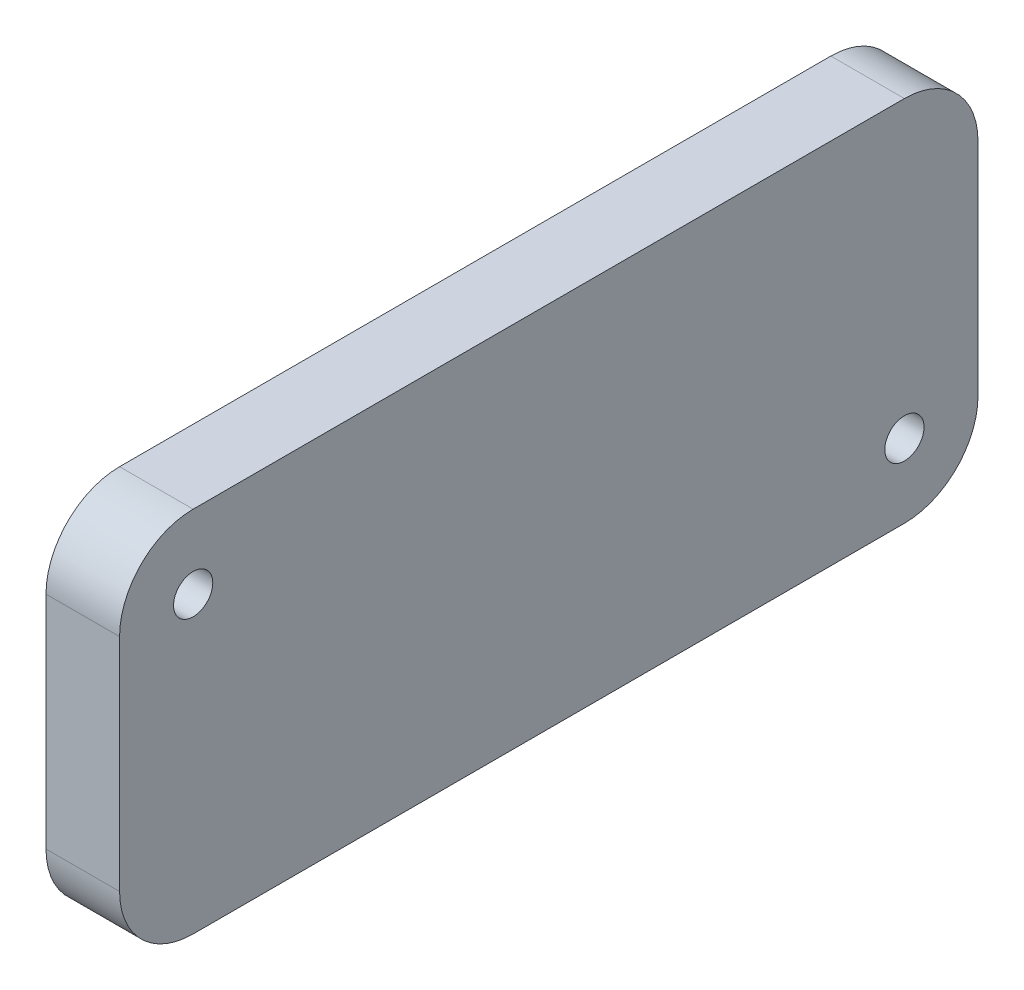
ISO-10303-21;
HEADER;
FILE_DESCRIPTION(('STEP AP214'),'2;1');
FILE_NAME('part.step','',(''),(''),'','','');
FILE_SCHEMA(('AUTOMOTIVE_DESIGN { 1 0 10303 214 1 1 1 1 }'));
ENDSEC;
DATA;
#1=APPLICATION_CONTEXT('core data for automotive mechanical design processes');
#2=APPLICATION_PROTOCOL_DEFINITION('international standard','automotive_design',2000,#1);
#3=PRODUCT_CONTEXT('',#1,'mechanical');
#4=PRODUCT('Part','Part','',(#3));
#5=PRODUCT_RELATED_PRODUCT_CATEGORY('part','',(#4));
#6=PRODUCT_DEFINITION_FORMATION('','',#4);
#7=PRODUCT_DEFINITION_CONTEXT('part definition',#1,'design');
#8=PRODUCT_DEFINITION('design','',#6,#7);
#9=PRODUCT_DEFINITION_SHAPE('','',#8);
#10=(LENGTH_UNIT() NAMED_UNIT(*) SI_UNIT(.MILLI.,.METRE.));
#11=(NAMED_UNIT(*) PLANE_ANGLE_UNIT() SI_UNIT($,.RADIAN.));
#12=(NAMED_UNIT(*) SI_UNIT($,.STERADIAN.) SOLID_ANGLE_UNIT());
#13=UNCERTAINTY_MEASURE_WITH_UNIT(LENGTH_MEASURE(1.E-05),#10,'distance_accuracy_value','');
#14=(GEOMETRIC_REPRESENTATION_CONTEXT(3) GLOBAL_UNCERTAINTY_ASSIGNED_CONTEXT((#13)) GLOBAL_UNIT_ASSIGNED_CONTEXT((#10,
#11,#12)) REPRESENTATION_CONTEXT('',''));
#15=CARTESIAN_POINT('',(0.,0.,0.));
#16=DIRECTION('',(0.,0.,1.));
#17=DIRECTION('',(1.,0.,0.));
#18=AXIS2_PLACEMENT_3D('',#15,#16,#17);
#19=CARTESIAN_POINT('',(3.,0.,0.));
#20=DIRECTION('',(1.,0.,0.));
#21=DIRECTION('',(0.,0.,-1.));
#22=AXIS2_PLACEMENT_3D('',#19,#20,#21);
#23=PLANE('',#22);
#24=CARTESIAN_POINT('',(3.,4.5,14.5));
#25=DIRECTION('',(1.,0.,0.));
#26=DIRECTION('',(0.,0.,-1.));
#27=AXIS2_PLACEMENT_3D('',#24,#25,#26);
#28=CIRCLE('',#27,0.800000000000001);
#29=CARTESIAN_POINT('',(3.,4.5,13.7));
#30=VERTEX_POINT('',#29);
#31=EDGE_CURVE('E166',#30,#30,#28,.T.);
#32=ORIENTED_EDGE('',*,*,#31,.F.);
#33=EDGE_LOOP('',(#32));
#34=FACE_BOUND('',#33,.T.);
#35=DIRECTION('',(0.,-1.,0.));
#36=VECTOR('',#35,1.);
#37=CARTESIAN_POINT('',(3.,7.5,17.5));
#38=LINE('',#37,#36);
#39=CARTESIAN_POINT('',(3.,4.5,17.5));
#40=VERTEX_POINT('',#39);
#41=CARTESIAN_POINT('',(3.,-4.5,17.5));
#42=VERTEX_POINT('',#41);
#43=EDGE_CURVE('E173',#40,#42,#38,.T.);
#44=ORIENTED_EDGE('',*,*,#43,.T.);
#45=CARTESIAN_POINT('',(3.,-4.5,14.5));
#46=DIRECTION('',(1.,0.,0.));
#47=DIRECTION('',(0.,0.,-1.));
#48=AXIS2_PLACEMENT_3D('',#45,#46,#47);
#49=CIRCLE('',#48,3.);
#50=CARTESIAN_POINT('',(3.,-7.5,14.5));
#51=VERTEX_POINT('',#50);
#52=EDGE_CURVE('E150',#42,#51,#49,.T.);
#53=ORIENTED_EDGE('',*,*,#52,.T.);
#54=DIRECTION('',(0.,0.,-1.));
#55=VECTOR('',#54,1.);
#56=CARTESIAN_POINT('',(3.,-7.5,17.5));
#57=LINE('',#56,#55);
#58=CARTESIAN_POINT('',(3.,-7.5,-14.5));
#59=VERTEX_POINT('',#58);
#60=EDGE_CURVE('E121',#51,#59,#57,.T.);
#61=ORIENTED_EDGE('',*,*,#60,.T.);
#62=CARTESIAN_POINT('',(3.,-4.5,-14.5));
#63=DIRECTION('',(1.,0.,0.));
#64=DIRECTION('',(0.,0.,-1.));
#65=AXIS2_PLACEMENT_3D('',#62,#63,#64);
#66=CIRCLE('',#65,3.);
#67=CARTESIAN_POINT('',(3.,-4.5,-17.5));
#68=VERTEX_POINT('',#67);
#69=EDGE_CURVE('E145',#59,#68,#66,.T.);
#70=ORIENTED_EDGE('',*,*,#69,.T.);
#71=DIRECTION('',(0.,1.,0.));
#72=VECTOR('',#71,1.);
#73=CARTESIAN_POINT('',(3.,7.5,-17.5));
#74=LINE('',#73,#72);
#75=CARTESIAN_POINT('',(3.,4.5,-17.5));
#76=VERTEX_POINT('',#75);
#77=EDGE_CURVE('E128',#68,#76,#74,.T.);
#78=ORIENTED_EDGE('',*,*,#77,.T.);
#79=CARTESIAN_POINT('',(3.,4.5,-14.5));
#80=DIRECTION('',(1.,0.,0.));
#81=DIRECTION('',(0.,0.,-1.));
#82=AXIS2_PLACEMENT_3D('',#79,#80,#81);
#83=CIRCLE('',#82,3.);
#84=CARTESIAN_POINT('',(3.,7.5,-14.5));
#85=VERTEX_POINT('',#84);
#86=EDGE_CURVE('E57',#76,#85,#83,.T.);
#87=ORIENTED_EDGE('',*,*,#86,.T.);
#88=DIRECTION('',(0.,0.,1.));
#89=VECTOR('',#88,1.);
#90=CARTESIAN_POINT('',(3.,7.5,17.5));
#91=LINE('',#90,#89);
#92=CARTESIAN_POINT('',(3.,7.5,14.5));
#93=VERTEX_POINT('',#92);
#94=EDGE_CURVE('E131',#85,#93,#91,.T.);
#95=ORIENTED_EDGE('',*,*,#94,.T.);
#96=CARTESIAN_POINT('',(3.,4.5,14.5));
#97=DIRECTION('',(1.,0.,0.));
#98=DIRECTION('',(0.,0.,-1.));
#99=AXIS2_PLACEMENT_3D('',#96,#97,#98);
#100=CIRCLE('',#99,3.);
#101=EDGE_CURVE('E148',#93,#40,#100,.T.);
#102=ORIENTED_EDGE('',*,*,#101,.T.);
#103=EDGE_LOOP('',(#44,#53,#61,#70,#78,#87,#95,#102));
#104=FACE_BOUND('',#103,.T.);
#105=CARTESIAN_POINT('',(3.,-4.5,-14.5));
#106=DIRECTION('',(1.,0.,0.));
#107=DIRECTION('',(0.,0.,-1.));
#108=AXIS2_PLACEMENT_3D('',#105,#106,#107);
#109=CIRCLE('',#108,0.800000000000001);
#110=CARTESIAN_POINT('',(3.,-4.5,-15.3));
#111=VERTEX_POINT('',#110);
#112=EDGE_CURVE('E178',#111,#111,#109,.T.);
#113=ORIENTED_EDGE('',*,*,#112,.F.);
#114=EDGE_LOOP('',(#113));
#115=FACE_BOUND('',#114,.T.);
#116=ADVANCED_FACE('F35',(#34,#104,#115),#23,.T.);
#117=CARTESIAN_POINT('',(0.,0.,0.));
#118=DIRECTION('',(1.,0.,0.));
#119=DIRECTION('',(0.,0.,-1.));
#120=AXIS2_PLACEMENT_3D('',#117,#118,#119);
#121=PLANE('',#120);
#122=DIRECTION('',(0.,0.,-1.));
#123=VECTOR('',#122,1.);
#124=CARTESIAN_POINT('',(0.,-7.5,17.5));
#125=LINE('',#124,#123);
#126=CARTESIAN_POINT('',(0.,-7.5,14.5));
#127=VERTEX_POINT('',#126);
#128=CARTESIAN_POINT('',(0.,-7.5,-14.5));
#129=VERTEX_POINT('',#128);
#130=EDGE_CURVE('E118',#127,#129,#125,.T.);
#131=ORIENTED_EDGE('',*,*,#130,.F.);
#132=CARTESIAN_POINT('',(0.,-4.5,14.5));
#133=DIRECTION('',(1.,0.,0.));
#134=DIRECTION('',(0.,0.,-1.));
#135=AXIS2_PLACEMENT_3D('',#132,#133,#134);
#136=CIRCLE('',#135,3.);
#137=CARTESIAN_POINT('',(0.,-4.5,17.5));
#138=VERTEX_POINT('',#137);
#139=EDGE_CURVE('E101',#127,#138,#136,.F.);
#140=ORIENTED_EDGE('',*,*,#139,.T.);
#141=DIRECTION('',(0.,-1.,0.));
#142=VECTOR('',#141,1.);
#143=CARTESIAN_POINT('',(0.,7.5,17.5));
#144=LINE('',#143,#142);
#145=CARTESIAN_POINT('',(0.,4.5,17.5));
#146=VERTEX_POINT('',#145);
#147=EDGE_CURVE('E129',#146,#138,#144,.T.);
#148=ORIENTED_EDGE('',*,*,#147,.F.);
#149=CARTESIAN_POINT('',(0.,4.5,14.5));
#150=DIRECTION('',(1.,0.,0.));
#151=DIRECTION('',(0.,0.,-1.));
#152=AXIS2_PLACEMENT_3D('',#149,#150,#151);
#153=CIRCLE('',#152,3.);
#154=CARTESIAN_POINT('',(0.,7.5,14.5));
#155=VERTEX_POINT('',#154);
#156=EDGE_CURVE('E112',#146,#155,#153,.F.);
#157=ORIENTED_EDGE('',*,*,#156,.T.);
#158=DIRECTION('',(0.,0.,1.));
#159=VECTOR('',#158,1.);
#160=CARTESIAN_POINT('',(0.,7.5,17.5));
#161=LINE('',#160,#159);
#162=CARTESIAN_POINT('',(0.,7.5,-14.5));
#163=VERTEX_POINT('',#162);
#164=EDGE_CURVE('E133',#163,#155,#161,.T.);
#165=ORIENTED_EDGE('',*,*,#164,.F.);
#166=CARTESIAN_POINT('',(0.,4.5,-14.5));
#167=DIRECTION('',(1.,0.,0.));
#168=DIRECTION('',(0.,0.,-1.));
#169=AXIS2_PLACEMENT_3D('',#166,#167,#168);
#170=CIRCLE('',#169,3.);
#171=CARTESIAN_POINT('',(0.,4.5,-17.5));
#172=VERTEX_POINT('',#171);
#173=EDGE_CURVE('E139',#163,#172,#170,.F.);
#174=ORIENTED_EDGE('',*,*,#173,.T.);
#175=DIRECTION('',(0.,1.,0.));
#176=VECTOR('',#175,1.);
#177=CARTESIAN_POINT('',(0.,7.5,-17.5));
#178=LINE('',#177,#176);
#179=CARTESIAN_POINT('',(0.,-4.5,-17.5));
#180=VERTEX_POINT('',#179);
#181=EDGE_CURVE('E161',#180,#172,#178,.T.);
#182=ORIENTED_EDGE('',*,*,#181,.F.);
#183=CARTESIAN_POINT('',(0.,-4.5,-14.5));
#184=DIRECTION('',(1.,0.,0.));
#185=DIRECTION('',(0.,0.,-1.));
#186=AXIS2_PLACEMENT_3D('',#183,#184,#185);
#187=CIRCLE('',#186,3.);
#188=EDGE_CURVE('E122',#180,#129,#187,.F.);
#189=ORIENTED_EDGE('',*,*,#188,.T.);
#190=EDGE_LOOP('',(#131,#140,#148,#157,#165,#174,#182,#189));
#191=FACE_BOUND('',#190,.T.);
#192=CARTESIAN_POINT('',(0.,4.5,14.5));
#193=DIRECTION('',(1.,0.,0.));
#194=DIRECTION('',(0.,0.,-1.));
#195=AXIS2_PLACEMENT_3D('',#192,#193,#194);
#196=CIRCLE('',#195,0.800000000000001);
#197=CARTESIAN_POINT('',(0.,4.5,13.7));
#198=VERTEX_POINT('',#197);
#199=EDGE_CURVE('E169',#198,#198,#196,.T.);
#200=ORIENTED_EDGE('',*,*,#199,.T.);
#201=EDGE_LOOP('',(#200));
#202=FACE_BOUND('',#201,.T.);
#203=CARTESIAN_POINT('',(0.,-4.5,-14.5));
#204=DIRECTION('',(1.,0.,0.));
#205=DIRECTION('',(0.,0.,-1.));
#206=AXIS2_PLACEMENT_3D('',#203,#204,#205);
#207=CIRCLE('',#206,0.800000000000001);
#208=CARTESIAN_POINT('',(0.,-4.5,-15.3));
#209=VERTEX_POINT('',#208);
#210=EDGE_CURVE('E180',#209,#209,#207,.T.);
#211=ORIENTED_EDGE('',*,*,#210,.T.);
#212=EDGE_LOOP('',(#211));
#213=FACE_BOUND('',#212,.T.);
#214=ADVANCED_FACE('F125',(#191,#202,#213),#121,.F.);
#215=CARTESIAN_POINT('',(3.,7.5,-17.5));
#216=DIRECTION('',(0.,0.,1.));
#217=DIRECTION('',(1.,0.,0.));
#218=AXIS2_PLACEMENT_3D('',#215,#216,#217);
#219=PLANE('',#218);
#220=ORIENTED_EDGE('',*,*,#181,.T.);
#221=DIRECTION('',(-1.,0.,0.));
#222=VECTOR('',#221,1.);
#223=CARTESIAN_POINT('',(3.,4.5,-17.5));
#224=LINE('',#223,#222);
#225=EDGE_CURVE('E11',#172,#76,#224,.F.);
#226=ORIENTED_EDGE('',*,*,#225,.T.);
#227=ORIENTED_EDGE('',*,*,#77,.F.);
#228=DIRECTION('',(-1.,0.,0.));
#229=VECTOR('',#228,1.);
#230=CARTESIAN_POINT('',(3.,-4.5,-17.5));
#231=LINE('',#230,#229);
#232=EDGE_CURVE('E43',#68,#180,#231,.T.);
#233=ORIENTED_EDGE('',*,*,#232,.T.);
#234=EDGE_LOOP('',(#220,#226,#227,#233));
#235=FACE_BOUND('',#234,.T.);
#236=ADVANCED_FACE('F160',(#235),#219,.F.);
#237=CARTESIAN_POINT('',(3.,7.5,17.5));
#238=DIRECTION('',(0.,-1.,0.));
#239=DIRECTION('',(0.,0.,-1.));
#240=AXIS2_PLACEMENT_3D('',#237,#238,#239);
#241=PLANE('',#240);
#242=ORIENTED_EDGE('',*,*,#164,.T.);
#243=DIRECTION('',(-1.,0.,0.));
#244=VECTOR('',#243,1.);
#245=CARTESIAN_POINT('',(3.,7.5,14.5));
#246=LINE('',#245,#244);
#247=EDGE_CURVE('E50',#155,#93,#246,.F.);
#248=ORIENTED_EDGE('',*,*,#247,.T.);
#249=ORIENTED_EDGE('',*,*,#94,.F.);
#250=DIRECTION('',(-1.,0.,0.));
#251=VECTOR('',#250,1.);
#252=CARTESIAN_POINT('',(3.,7.5,-14.5));
#253=LINE('',#252,#251);
#254=EDGE_CURVE('E152',#85,#163,#253,.T.);
#255=ORIENTED_EDGE('',*,*,#254,.T.);
#256=EDGE_LOOP('',(#242,#248,#249,#255));
#257=FACE_BOUND('',#256,.T.);
#258=ADVANCED_FACE('F206',(#257),#241,.F.);
#259=CARTESIAN_POINT('',(3.,7.5,17.5));
#260=DIRECTION('',(0.,0.,-1.));
#261=DIRECTION('',(-1.,0.,0.));
#262=AXIS2_PLACEMENT_3D('',#259,#260,#261);
#263=PLANE('',#262);
#264=ORIENTED_EDGE('',*,*,#147,.T.);
#265=DIRECTION('',(-1.,0.,0.));
#266=VECTOR('',#265,1.);
#267=CARTESIAN_POINT('',(3.,-4.5,17.5));
#268=LINE('',#267,#266);
#269=EDGE_CURVE('E106',#138,#42,#268,.F.);
#270=ORIENTED_EDGE('',*,*,#269,.T.);
#271=ORIENTED_EDGE('',*,*,#43,.F.);
#272=DIRECTION('',(-1.,0.,0.));
#273=VECTOR('',#272,1.);
#274=CARTESIAN_POINT('',(3.,4.5,17.5));
#275=LINE('',#274,#273);
#276=EDGE_CURVE('E111',#40,#146,#275,.T.);
#277=ORIENTED_EDGE('',*,*,#276,.T.);
#278=EDGE_LOOP('',(#264,#270,#271,#277));
#279=FACE_BOUND('',#278,.T.);
#280=ADVANCED_FACE('F203',(#279),#263,.F.);
#281=CARTESIAN_POINT('',(3.,-7.5,17.5));
#282=DIRECTION('',(0.,1.,0.));
#283=DIRECTION('',(0.,0.,1.));
#284=AXIS2_PLACEMENT_3D('',#281,#282,#283);
#285=PLANE('',#284);
#286=ORIENTED_EDGE('',*,*,#60,.F.);
#287=DIRECTION('',(-1.,0.,0.));
#288=VECTOR('',#287,1.);
#289=CARTESIAN_POINT('',(3.,-7.5,14.5));
#290=LINE('',#289,#288);
#291=EDGE_CURVE('E105',#51,#127,#290,.T.);
#292=ORIENTED_EDGE('',*,*,#291,.T.);
#293=ORIENTED_EDGE('',*,*,#130,.T.);
#294=DIRECTION('',(-1.,0.,0.));
#295=VECTOR('',#294,1.);
#296=CARTESIAN_POINT('',(3.,-7.5,-14.5));
#297=LINE('',#296,#295);
#298=EDGE_CURVE('E123',#129,#59,#297,.F.);
#299=ORIENTED_EDGE('',*,*,#298,.T.);
#300=EDGE_LOOP('',(#286,#292,#293,#299));
#301=FACE_BOUND('',#300,.T.);
#302=ADVANCED_FACE('F117',(#301),#285,.F.);
#303=CARTESIAN_POINT('',(3.,4.5,14.5));
#304=DIRECTION('',(-1.,0.,0.));
#305=DIRECTION('',(0.,0.,1.));
#306=AXIS2_PLACEMENT_3D('',#303,#304,#305);
#307=CYLINDRICAL_SURFACE('',#306,0.800000000000001);
#308=ORIENTED_EDGE('',*,*,#31,.T.);
#309=EDGE_LOOP('',(#308));
#310=FACE_BOUND('',#309,.T.);
#311=ORIENTED_EDGE('',*,*,#199,.F.);
#312=EDGE_LOOP('',(#311));
#313=FACE_BOUND('',#312,.T.);
#314=ADVANCED_FACE('F198',(#310,#313),#307,.F.);
#315=CARTESIAN_POINT('',(3.,-4.5,-14.5));
#316=DIRECTION('',(-1.,0.,0.));
#317=DIRECTION('',(0.,0.,1.));
#318=AXIS2_PLACEMENT_3D('',#315,#316,#317);
#319=CYLINDRICAL_SURFACE('',#318,0.800000000000001);
#320=ORIENTED_EDGE('',*,*,#112,.T.);
#321=EDGE_LOOP('',(#320));
#322=FACE_BOUND('',#321,.T.);
#323=ORIENTED_EDGE('',*,*,#210,.F.);
#324=EDGE_LOOP('',(#323));
#325=FACE_BOUND('',#324,.T.);
#326=ADVANCED_FACE('F186',(#322,#325),#319,.F.);
#327=CARTESIAN_POINT('',(3.,-4.5,14.5));
#328=DIRECTION('',(-1.,0.,0.));
#329=DIRECTION('',(0.,0.,1.));
#330=AXIS2_PLACEMENT_3D('',#327,#328,#329);
#331=CYLINDRICAL_SURFACE('',#330,3.);
#332=ORIENTED_EDGE('',*,*,#52,.F.);
#333=ORIENTED_EDGE('',*,*,#269,.F.);
#334=ORIENTED_EDGE('',*,*,#139,.F.);
#335=ORIENTED_EDGE('',*,*,#291,.F.);
#336=EDGE_LOOP('',(#332,#333,#334,#335));
#337=FACE_BOUND('',#336,.T.);
#338=ADVANCED_FACE('F104',(#337),#331,.T.);
#339=CARTESIAN_POINT('',(3.,4.5,14.5));
#340=DIRECTION('',(-1.,0.,0.));
#341=DIRECTION('',(0.,0.,1.));
#342=AXIS2_PLACEMENT_3D('',#339,#340,#341);
#343=CYLINDRICAL_SURFACE('',#342,3.);
#344=ORIENTED_EDGE('',*,*,#101,.F.);
#345=ORIENTED_EDGE('',*,*,#247,.F.);
#346=ORIENTED_EDGE('',*,*,#156,.F.);
#347=ORIENTED_EDGE('',*,*,#276,.F.);
#348=EDGE_LOOP('',(#344,#345,#346,#347));
#349=FACE_BOUND('',#348,.T.);
#350=ADVANCED_FACE('F214',(#349),#343,.T.);
#351=CARTESIAN_POINT('',(3.,4.5,-14.5));
#352=DIRECTION('',(-1.,0.,0.));
#353=DIRECTION('',(0.,0.,1.));
#354=AXIS2_PLACEMENT_3D('',#351,#352,#353);
#355=CYLINDRICAL_SURFACE('',#354,3.);
#356=ORIENTED_EDGE('',*,*,#86,.F.);
#357=ORIENTED_EDGE('',*,*,#225,.F.);
#358=ORIENTED_EDGE('',*,*,#173,.F.);
#359=ORIENTED_EDGE('',*,*,#254,.F.);
#360=EDGE_LOOP('',(#356,#357,#358,#359));
#361=FACE_BOUND('',#360,.T.);
#362=ADVANCED_FACE('F216',(#361),#355,.T.);
#363=CARTESIAN_POINT('',(3.,-4.5,-14.5));
#364=DIRECTION('',(-1.,0.,0.));
#365=DIRECTION('',(0.,0.,1.));
#366=AXIS2_PLACEMENT_3D('',#363,#364,#365);
#367=CYLINDRICAL_SURFACE('',#366,3.);
#368=ORIENTED_EDGE('',*,*,#69,.F.);
#369=ORIENTED_EDGE('',*,*,#298,.F.);
#370=ORIENTED_EDGE('',*,*,#188,.F.);
#371=ORIENTED_EDGE('',*,*,#232,.F.);
#372=EDGE_LOOP('',(#368,#369,#370,#371));
#373=FACE_BOUND('',#372,.T.);
#374=ADVANCED_FACE('F37',(#373),#367,.T.);
#375=CLOSED_SHELL('',(#116,#214,#236,#258,#280,#302,#314,#326,#338,#350,#362,#374));
#376=MANIFOLD_SOLID_BREP('B2',#375);
#377=ADVANCED_BREP_SHAPE_REPRESENTATION('',(#18,#376),#14);
#378=SHAPE_DEFINITION_REPRESENTATION(#9,#377);
ENDSEC;
END-ISO-10303-21;
